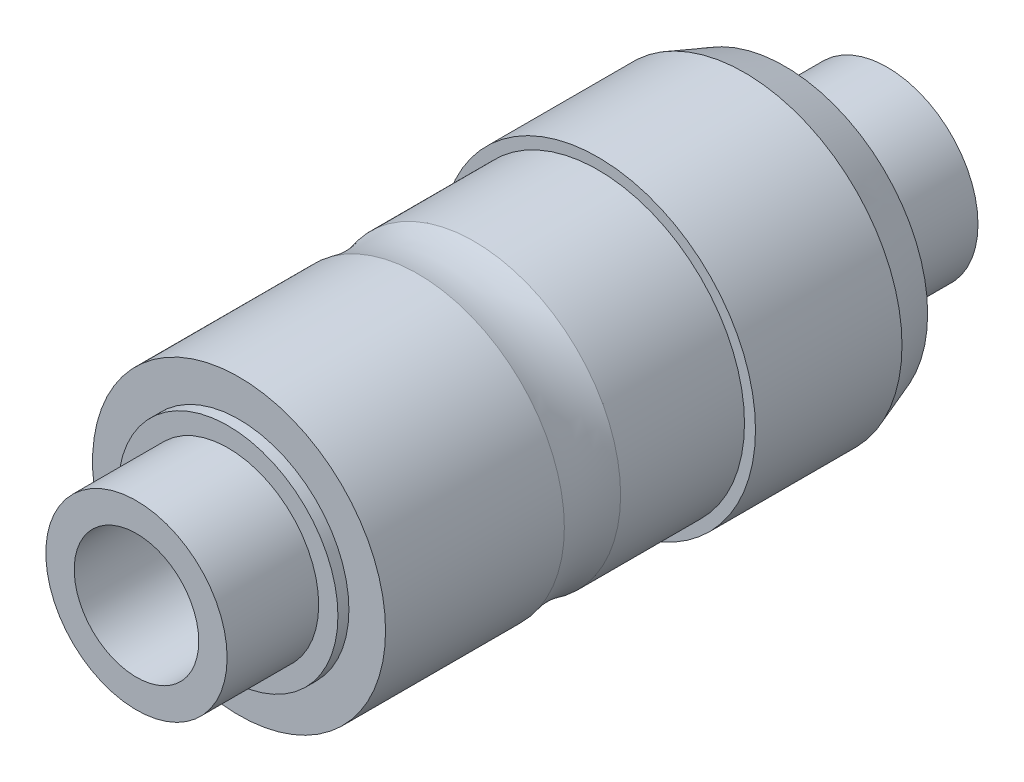
ISO-10303-21;
HEADER;
FILE_DESCRIPTION(('STEP AP214'),'2;1');
FILE_NAME('part.step','',(''),(''),'','','');
FILE_SCHEMA(('AUTOMOTIVE_DESIGN { 1 0 10303 214 1 1 1 1 }'));
ENDSEC;
DATA;
#1=APPLICATION_CONTEXT('core data for automotive mechanical design processes');
#2=APPLICATION_PROTOCOL_DEFINITION('international standard','automotive_design',2000,#1);
#3=PRODUCT_CONTEXT('',#1,'mechanical');
#4=PRODUCT('Part','Part','',(#3));
#5=PRODUCT_RELATED_PRODUCT_CATEGORY('part','',(#4));
#6=PRODUCT_DEFINITION_FORMATION('','',#4);
#7=PRODUCT_DEFINITION_CONTEXT('part definition',#1,'design');
#8=PRODUCT_DEFINITION('design','',#6,#7);
#9=PRODUCT_DEFINITION_SHAPE('','',#8);
#10=(LENGTH_UNIT() NAMED_UNIT(*) SI_UNIT(.MILLI.,.METRE.));
#11=(NAMED_UNIT(*) PLANE_ANGLE_UNIT() SI_UNIT($,.RADIAN.));
#12=(NAMED_UNIT(*) SI_UNIT($,.STERADIAN.) SOLID_ANGLE_UNIT());
#13=UNCERTAINTY_MEASURE_WITH_UNIT(LENGTH_MEASURE(1.E-05),#10,'distance_accuracy_value','');
#14=(GEOMETRIC_REPRESENTATION_CONTEXT(3) GLOBAL_UNCERTAINTY_ASSIGNED_CONTEXT((#13)) GLOBAL_UNIT_ASSIGNED_CONTEXT((#10,
#11,#12)) REPRESENTATION_CONTEXT('',''));
#15=CARTESIAN_POINT('',(0.,0.,0.));
#16=DIRECTION('',(0.,0.,1.));
#17=DIRECTION('',(1.,0.,0.));
#18=AXIS2_PLACEMENT_3D('',#15,#16,#17);
#19=CARTESIAN_POINT('',(0.,0.,5.));
#20=DIRECTION('',(0.,0.,1.));
#21=DIRECTION('',(1.,0.,0.));
#22=AXIS2_PLACEMENT_3D('',#19,#20,#21);
#23=PLANE('',#22);
#24=CARTESIAN_POINT('',(0.,0.,5.));
#25=DIRECTION('',(0.,0.,1.));
#26=DIRECTION('',(1.,0.,0.));
#27=AXIS2_PLACEMENT_3D('',#24,#25,#26);
#28=CIRCLE('',#27,4.);
#29=CARTESIAN_POINT('',(4.,0.,5.));
#30=VERTEX_POINT('',#29);
#31=EDGE_CURVE('E17',#30,#30,#28,.T.);
#32=ORIENTED_EDGE('',*,*,#31,.F.);
#33=EDGE_LOOP('',(#32));
#34=FACE_BOUND('',#33,.T.);
#35=CARTESIAN_POINT('',(0.,0.,5.));
#36=DIRECTION('',(0.,0.,1.));
#37=DIRECTION('',(1.,0.,0.));
#38=AXIS2_PLACEMENT_3D('',#35,#36,#37);
#39=CIRCLE('',#38,4.3);
#40=CARTESIAN_POINT('',(4.3,0.,5.));
#41=VERTEX_POINT('',#40);
#42=EDGE_CURVE('E61',#41,#41,#39,.F.);
#43=ORIENTED_EDGE('',*,*,#42,.F.);
#44=EDGE_LOOP('',(#43));
#45=FACE_BOUND('',#44,.T.);
#46=ADVANCED_FACE('F14',(#34,#45),#23,.T.);
#47=CARTESIAN_POINT('',(0.,0.,4.19094271260656));
#48=DIRECTION('',(0.,0.,1.));
#49=DIRECTION('',(1.,0.,0.));
#50=AXIS2_PLACEMENT_3D('',#47,#48,#49);
#51=CYLINDRICAL_SURFACE('',#50,4.);
#52=CARTESIAN_POINT('',(0.,0.,8.38188542521313));
#53=DIRECTION('',(0.,0.,1.));
#54=DIRECTION('',(1.,0.,0.));
#55=AXIS2_PLACEMENT_3D('',#52,#53,#54);
#56=CIRCLE('',#55,4.);
#57=CARTESIAN_POINT('',(4.,0.,8.38188542521313));
#58=VERTEX_POINT('',#57);
#59=EDGE_CURVE('E63',#58,#58,#56,.F.);
#60=ORIENTED_EDGE('',*,*,#59,.T.);
#61=EDGE_LOOP('',(#60));
#62=FACE_BOUND('',#61,.T.);
#63=ORIENTED_EDGE('',*,*,#31,.T.);
#64=EDGE_LOOP('',(#63));
#65=FACE_BOUND('',#64,.T.);
#66=ADVANCED_FACE('F71',(#62,#65),#51,.T.);
#67=CARTESIAN_POINT('',(0.,0.,0.));
#68=DIRECTION('',(0.,0.,1.));
#69=DIRECTION('',(1.,0.,0.));
#70=AXIS2_PLACEMENT_3D('',#67,#68,#69);
#71=CYLINDRICAL_SURFACE('',#70,4.3);
#72=CARTESIAN_POINT('',(0.,0.,0.999999999976353));
#73=DIRECTION('',(0.,0.,1.));
#74=DIRECTION('',(1.,0.,0.));
#75=AXIS2_PLACEMENT_3D('',#72,#73,#74);
#76=CIRCLE('',#75,4.30000000000064);
#77=CARTESIAN_POINT('',(4.30000000000064,0.,0.999999999976353));
#78=VERTEX_POINT('',#77);
#79=EDGE_CURVE('E67',#78,#78,#76,.F.);
#80=ORIENTED_EDGE('',*,*,#79,.F.);
#81=EDGE_LOOP('',(#80));
#82=FACE_BOUND('',#81,.T.);
#83=ORIENTED_EDGE('',*,*,#42,.T.);
#84=EDGE_LOOP('',(#83));
#85=FACE_BOUND('',#84,.T.);
#86=ADVANCED_FACE('F79',(#82,#85),#71,.T.);
#87=CARTESIAN_POINT('',(0.,0.,9.14999999999999));
#88=DIRECTION('',(0.,0.,1.));
#89=DIRECTION('',(1.,0.,0.));
#90=AXIS2_PLACEMENT_3D('',#87,#88,#89);
#91=TOROIDAL_SURFACE('',#90,6.9,3.);
#92=CARTESIAN_POINT('',(0.,0.,9.91811457478686));
#93=DIRECTION('',(0.,0.,1.));
#94=DIRECTION('',(1.,0.,0.));
#95=AXIS2_PLACEMENT_3D('',#92,#93,#94);
#96=CIRCLE('',#95,4.);
#97=CARTESIAN_POINT('',(4.,0.,9.91811457478686));
#98=VERTEX_POINT('',#97);
#99=EDGE_CURVE('E60',#98,#98,#96,.T.);
#100=ORIENTED_EDGE('',*,*,#99,.F.);
#101=EDGE_LOOP('',(#100));
#102=FACE_BOUND('',#101,.T.);
#103=ORIENTED_EDGE('',*,*,#59,.F.);
#104=EDGE_LOOP('',(#103));
#105=FACE_BOUND('',#104,.T.);
#106=ADVANCED_FACE('F135',(#102,#105),#91,.F.);
#107=CARTESIAN_POINT('',(0.,0.,0.999999999862666));
#108=DIRECTION('',(0.,0.,1.));
#109=DIRECTION('',(1.,0.,0.));
#110=AXIS2_PLACEMENT_3D('',#107,#108,#109);
#111=CONICAL_SURFACE('',#110,4.29999999994379,0.348771003585982);
#112=CARTESIAN_POINT('',(0.,0.,-0.0999999999748979));
#113=DIRECTION('',(0.,0.,1.));
#114=DIRECTION('',(1.,0.,0.));
#115=AXIS2_PLACEMENT_3D('',#112,#113,#114);
#116=CIRCLE('',#115,3.90000000000028);
#117=CARTESIAN_POINT('',(3.90000000000028,0.,-0.0999999999748979));
#118=VERTEX_POINT('',#117);
#119=EDGE_CURVE('E58',#118,#118,#116,.T.);
#120=ORIENTED_EDGE('',*,*,#119,.T.);
#121=EDGE_LOOP('',(#120));
#122=FACE_BOUND('',#121,.T.);
#123=ORIENTED_EDGE('',*,*,#79,.T.);
#124=EDGE_LOOP('',(#123));
#125=FACE_BOUND('',#124,.T.);
#126=ADVANCED_FACE('F131',(#122,#125),#111,.T.);
#127=CARTESIAN_POINT('',(0.,0.,12.3590572873934));
#128=DIRECTION('',(0.,0.,1.));
#129=DIRECTION('',(1.,0.,0.));
#130=AXIS2_PLACEMENT_3D('',#127,#128,#129);
#131=CYLINDRICAL_SURFACE('',#130,4.);
#132=CARTESIAN_POINT('',(0.,0.,14.8));
#133=DIRECTION('',(0.,0.,1.));
#134=DIRECTION('',(1.,0.,0.));
#135=AXIS2_PLACEMENT_3D('',#132,#133,#134);
#136=CIRCLE('',#135,4.);
#137=CARTESIAN_POINT('',(4.,0.,14.8));
#138=VERTEX_POINT('',#137);
#139=EDGE_CURVE('E55',#138,#138,#136,.T.);
#140=ORIENTED_EDGE('',*,*,#139,.F.);
#141=EDGE_LOOP('',(#140));
#142=FACE_BOUND('',#141,.T.);
#143=ORIENTED_EDGE('',*,*,#99,.T.);
#144=EDGE_LOOP('',(#143));
#145=FACE_BOUND('',#144,.T.);
#146=ADVANCED_FACE('F127',(#142,#145),#131,.T.);
#147=CARTESIAN_POINT('',(0.,0.,-0.100000000000002));
#148=DIRECTION('',(0.,0.,1.));
#149=DIRECTION('',(1.,0.,0.));
#150=AXIS2_PLACEMENT_3D('',#147,#148,#149);
#151=PLANE('',#150);
#152=CARTESIAN_POINT('',(0.,0.,-0.100000000000002));
#153=DIRECTION('',(0.,0.,1.));
#154=DIRECTION('',(1.,0.,0.));
#155=AXIS2_PLACEMENT_3D('',#152,#153,#154);
#156=CIRCLE('',#155,3.);
#157=CARTESIAN_POINT('',(3.,0.,-0.100000000000002));
#158=VERTEX_POINT('',#157);
#159=EDGE_CURVE('E52',#158,#158,#156,.F.);
#160=ORIENTED_EDGE('',*,*,#159,.F.);
#161=EDGE_LOOP('',(#160));
#162=FACE_BOUND('',#161,.T.);
#163=ORIENTED_EDGE('',*,*,#119,.F.);
#164=EDGE_LOOP('',(#163));
#165=FACE_BOUND('',#164,.T.);
#166=ADVANCED_FACE('F123',(#162,#165),#151,.F.);
#167=CARTESIAN_POINT('',(1.7,0.,14.8));
#168=DIRECTION('',(0.,0.,1.));
#169=DIRECTION('',(1.,0.,0.));
#170=AXIS2_PLACEMENT_3D('',#167,#168,#169);
#171=PLANE('',#170);
#172=CARTESIAN_POINT('',(0.,0.,14.8));
#173=DIRECTION('',(0.,0.,1.));
#174=DIRECTION('',(1.,0.,0.));
#175=AXIS2_PLACEMENT_3D('',#172,#173,#174);
#176=CIRCLE('',#175,3.);
#177=CARTESIAN_POINT('',(3.,0.,14.8));
#178=VERTEX_POINT('',#177);
#179=EDGE_CURVE('E49',#178,#178,#176,.T.);
#180=ORIENTED_EDGE('',*,*,#179,.F.);
#181=EDGE_LOOP('',(#180));
#182=FACE_BOUND('',#181,.T.);
#183=ORIENTED_EDGE('',*,*,#139,.T.);
#184=EDGE_LOOP('',(#183));
#185=FACE_BOUND('',#184,.T.);
#186=ADVANCED_FACE('F119',(#182,#185),#171,.T.);
#187=CARTESIAN_POINT('',(0.,0.,-0.100000000000002));
#188=DIRECTION('',(0.,0.,1.));
#189=DIRECTION('',(1.,0.,0.));
#190=AXIS2_PLACEMENT_3D('',#187,#188,#189);
#191=CYLINDRICAL_SURFACE('',#190,3.);
#192=ORIENTED_EDGE('',*,*,#159,.T.);
#193=EDGE_LOOP('',(#192));
#194=FACE_BOUND('',#193,.T.);
#195=CARTESIAN_POINT('',(0.,0.,-0.400000000000003));
#196=DIRECTION('',(0.,0.,1.));
#197=DIRECTION('',(1.,0.,0.));
#198=AXIS2_PLACEMENT_3D('',#195,#196,#197);
#199=CIRCLE('',#198,3.);
#200=CARTESIAN_POINT('',(3.,0.,-0.400000000000003));
#201=VERTEX_POINT('',#200);
#202=EDGE_CURVE('E46',#201,#201,#199,.T.);
#203=ORIENTED_EDGE('',*,*,#202,.T.);
#204=EDGE_LOOP('',(#203));
#205=FACE_BOUND('',#204,.T.);
#206=ADVANCED_FACE('F115',(#194,#205),#191,.T.);
#207=CARTESIAN_POINT('',(0.,0.,14.8));
#208=DIRECTION('',(0.,0.,1.));
#209=DIRECTION('',(1.,0.,0.));
#210=AXIS2_PLACEMENT_3D('',#207,#208,#209);
#211=CYLINDRICAL_SURFACE('',#210,3.);
#212=ORIENTED_EDGE('',*,*,#179,.T.);
#213=EDGE_LOOP('',(#212));
#214=FACE_BOUND('',#213,.T.);
#215=CARTESIAN_POINT('',(0.,0.,15.1));
#216=DIRECTION('',(0.,0.,1.));
#217=DIRECTION('',(1.,0.,0.));
#218=AXIS2_PLACEMENT_3D('',#215,#216,#217);
#219=CIRCLE('',#218,3.);
#220=CARTESIAN_POINT('',(3.,0.,15.1));
#221=VERTEX_POINT('',#220);
#222=EDGE_CURVE('E43',#221,#221,#219,.T.);
#223=ORIENTED_EDGE('',*,*,#222,.F.);
#224=EDGE_LOOP('',(#223));
#225=FACE_BOUND('',#224,.T.);
#226=ADVANCED_FACE('F111',(#214,#225),#211,.T.);
#227=CARTESIAN_POINT('',(0.,0.,-0.400000000000003));
#228=DIRECTION('',(0.,0.,1.));
#229=DIRECTION('',(1.,0.,0.));
#230=AXIS2_PLACEMENT_3D('',#227,#228,#229);
#231=PLANE('',#230);
#232=CARTESIAN_POINT('',(0.,0.,-0.400000000000003));
#233=DIRECTION('',(0.,0.,1.));
#234=DIRECTION('',(1.,0.,0.));
#235=AXIS2_PLACEMENT_3D('',#232,#233,#234);
#236=CIRCLE('',#235,2.475);
#237=CARTESIAN_POINT('',(2.475,0.,-0.400000000000003));
#238=VERTEX_POINT('',#237);
#239=EDGE_CURVE('E40',#238,#238,#236,.F.);
#240=ORIENTED_EDGE('',*,*,#239,.F.);
#241=EDGE_LOOP('',(#240));
#242=FACE_BOUND('',#241,.T.);
#243=ORIENTED_EDGE('',*,*,#202,.F.);
#244=EDGE_LOOP('',(#243));
#245=FACE_BOUND('',#244,.T.);
#246=ADVANCED_FACE('F107',(#242,#245),#231,.F.);
#247=CARTESIAN_POINT('',(0.,0.,15.1));
#248=DIRECTION('',(0.,0.,1.));
#249=DIRECTION('',(1.,0.,0.));
#250=AXIS2_PLACEMENT_3D('',#247,#248,#249);
#251=PLANE('',#250);
#252=CARTESIAN_POINT('',(0.,0.,15.1));
#253=DIRECTION('',(0.,0.,1.));
#254=DIRECTION('',(1.,0.,0.));
#255=AXIS2_PLACEMENT_3D('',#252,#253,#254);
#256=CIRCLE('',#255,2.475);
#257=CARTESIAN_POINT('',(2.475,0.,15.1));
#258=VERTEX_POINT('',#257);
#259=EDGE_CURVE('E37',#258,#258,#256,.T.);
#260=ORIENTED_EDGE('',*,*,#259,.F.);
#261=EDGE_LOOP('',(#260));
#262=FACE_BOUND('',#261,.T.);
#263=ORIENTED_EDGE('',*,*,#222,.T.);
#264=EDGE_LOOP('',(#263));
#265=FACE_BOUND('',#264,.T.);
#266=ADVANCED_FACE('F103',(#262,#265),#251,.T.);
#267=CARTESIAN_POINT('',(0.,0.,-0.100000000000002));
#268=DIRECTION('',(0.,0.,1.));
#269=DIRECTION('',(1.,0.,0.));
#270=AXIS2_PLACEMENT_3D('',#267,#268,#269);
#271=CYLINDRICAL_SURFACE('',#270,2.475);
#272=ORIENTED_EDGE('',*,*,#239,.T.);
#273=EDGE_LOOP('',(#272));
#274=FACE_BOUND('',#273,.T.);
#275=CARTESIAN_POINT('',(0.,0.,-2.9));
#276=DIRECTION('',(0.,0.,1.));
#277=DIRECTION('',(1.,0.,0.));
#278=AXIS2_PLACEMENT_3D('',#275,#276,#277);
#279=CIRCLE('',#278,2.475);
#280=CARTESIAN_POINT('',(2.475,0.,-2.9));
#281=VERTEX_POINT('',#280);
#282=EDGE_CURVE('E34',#281,#281,#279,.T.);
#283=ORIENTED_EDGE('',*,*,#282,.T.);
#284=EDGE_LOOP('',(#283));
#285=FACE_BOUND('',#284,.T.);
#286=ADVANCED_FACE('F99',(#274,#285),#271,.T.);
#287=CARTESIAN_POINT('',(0.,0.,14.8));
#288=DIRECTION('',(0.,0.,1.));
#289=DIRECTION('',(1.,0.,0.));
#290=AXIS2_PLACEMENT_3D('',#287,#288,#289);
#291=CYLINDRICAL_SURFACE('',#290,2.475);
#292=ORIENTED_EDGE('',*,*,#259,.T.);
#293=EDGE_LOOP('',(#292));
#294=FACE_BOUND('',#293,.T.);
#295=CARTESIAN_POINT('',(0.,0.,17.6));
#296=DIRECTION('',(0.,0.,1.));
#297=DIRECTION('',(1.,0.,0.));
#298=AXIS2_PLACEMENT_3D('',#295,#296,#297);
#299=CIRCLE('',#298,2.475);
#300=CARTESIAN_POINT('',(2.475,0.,17.6));
#301=VERTEX_POINT('',#300);
#302=EDGE_CURVE('E26',#301,#301,#299,.T.);
#303=ORIENTED_EDGE('',*,*,#302,.F.);
#304=EDGE_LOOP('',(#303));
#305=FACE_BOUND('',#304,.T.);
#306=ADVANCED_FACE('F95',(#294,#305),#291,.T.);
#307=CARTESIAN_POINT('',(0.,0.,-2.9));
#308=DIRECTION('',(0.,0.,1.));
#309=DIRECTION('',(1.,0.,0.));
#310=AXIS2_PLACEMENT_3D('',#307,#308,#309);
#311=PLANE('',#310);
#312=CARTESIAN_POINT('',(0.,0.,-2.9));
#313=DIRECTION('',(0.,0.,1.));
#314=DIRECTION('',(1.,0.,0.));
#315=AXIS2_PLACEMENT_3D('',#312,#313,#314);
#316=CIRCLE('',#315,1.7);
#317=CARTESIAN_POINT('',(1.7,0.,-2.9));
#318=VERTEX_POINT('',#317);
#319=EDGE_CURVE('E21',#318,#318,#316,.T.);
#320=ORIENTED_EDGE('',*,*,#319,.T.);
#321=EDGE_LOOP('',(#320));
#322=FACE_BOUND('',#321,.T.);
#323=ORIENTED_EDGE('',*,*,#282,.F.);
#324=EDGE_LOOP('',(#323));
#325=FACE_BOUND('',#324,.T.);
#326=ADVANCED_FACE('F89',(#322,#325),#311,.F.);
#327=CARTESIAN_POINT('',(0.,0.,17.6));
#328=DIRECTION('',(0.,0.,1.));
#329=DIRECTION('',(1.,0.,0.));
#330=AXIS2_PLACEMENT_3D('',#327,#328,#329);
#331=PLANE('',#330);
#332=CARTESIAN_POINT('',(0.,0.,17.6));
#333=DIRECTION('',(0.,0.,1.));
#334=DIRECTION('',(1.,0.,0.));
#335=AXIS2_PLACEMENT_3D('',#332,#333,#334);
#336=CIRCLE('',#335,1.7);
#337=CARTESIAN_POINT('',(1.7,0.,17.6));
#338=VERTEX_POINT('',#337);
#339=EDGE_CURVE('E10',#338,#338,#336,.F.);
#340=ORIENTED_EDGE('',*,*,#339,.T.);
#341=EDGE_LOOP('',(#340));
#342=FACE_BOUND('',#341,.T.);
#343=ORIENTED_EDGE('',*,*,#302,.T.);
#344=EDGE_LOOP('',(#343));
#345=FACE_BOUND('',#344,.T.);
#346=ADVANCED_FACE('F83',(#342,#345),#331,.T.);
#347=CARTESIAN_POINT('',(0.,0.,1.5));
#348=DIRECTION('',(0.,0.,1.));
#349=DIRECTION('',(1.,0.,0.));
#350=AXIS2_PLACEMENT_3D('',#347,#348,#349);
#351=CYLINDRICAL_SURFACE('',#350,1.7);
#352=ORIENTED_EDGE('',*,*,#339,.F.);
#353=EDGE_LOOP('',(#352));
#354=FACE_BOUND('',#353,.T.);
#355=ORIENTED_EDGE('',*,*,#319,.F.);
#356=EDGE_LOOP('',(#355));
#357=FACE_BOUND('',#356,.T.);
#358=ADVANCED_FACE('F81',(#354,#357),#351,.F.);
#359=CLOSED_SHELL('',(#46,#66,#86,#106,#126,#146,#166,#186,#206,#226,#246,#266,#286,#306,#326,
#346,#358));
#360=MANIFOLD_SOLID_BREP('B1',#359);
#361=ADVANCED_BREP_SHAPE_REPRESENTATION('',(#18,#360),#14);
#362=SHAPE_DEFINITION_REPRESENTATION(#9,#361);
ENDSEC;
END-ISO-10303-21;
